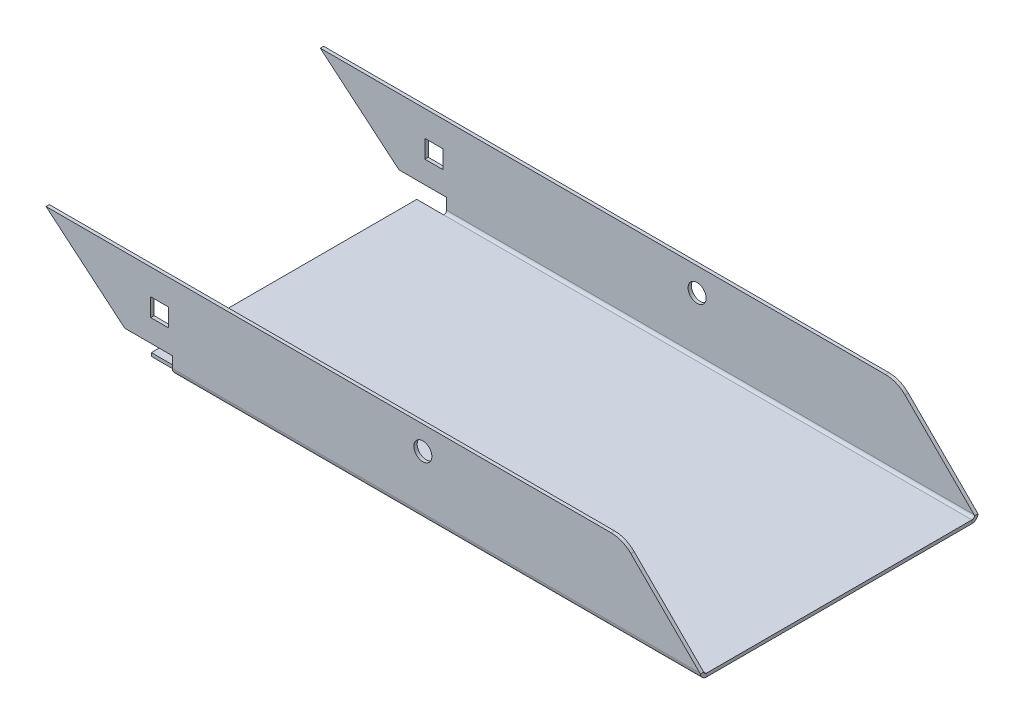
ISO-10303-21;
HEADER;
FILE_DESCRIPTION(('STEP AP214'),'2;1');
FILE_NAME('part.step','',(''),(''),'','','');
FILE_SCHEMA(('AUTOMOTIVE_DESIGN { 1 0 10303 214 1 1 1 1 }'));
ENDSEC;
DATA;
#1=APPLICATION_CONTEXT('core data for automotive mechanical design processes');
#2=APPLICATION_PROTOCOL_DEFINITION('international standard','automotive_design',2000,#1);
#3=PRODUCT_CONTEXT('',#1,'mechanical');
#4=PRODUCT('Part','Part','',(#3));
#5=PRODUCT_RELATED_PRODUCT_CATEGORY('part','',(#4));
#6=PRODUCT_DEFINITION_FORMATION('','',#4);
#7=PRODUCT_DEFINITION_CONTEXT('part definition',#1,'design');
#8=PRODUCT_DEFINITION('design','',#6,#7);
#9=PRODUCT_DEFINITION_SHAPE('','',#8);
#10=(LENGTH_UNIT() NAMED_UNIT(*) SI_UNIT(.MILLI.,.METRE.));
#11=(NAMED_UNIT(*) PLANE_ANGLE_UNIT() SI_UNIT($,.RADIAN.));
#12=(NAMED_UNIT(*) SI_UNIT($,.STERADIAN.) SOLID_ANGLE_UNIT());
#13=UNCERTAINTY_MEASURE_WITH_UNIT(LENGTH_MEASURE(1.E-05),#10,'distance_accuracy_value','');
#14=(GEOMETRIC_REPRESENTATION_CONTEXT(3) GLOBAL_UNCERTAINTY_ASSIGNED_CONTEXT((#13)) GLOBAL_UNIT_ASSIGNED_CONTEXT((#10,
#11,#12)) REPRESENTATION_CONTEXT('',''));
#15=CARTESIAN_POINT('',(0.,0.,0.));
#16=DIRECTION('',(0.,0.,1.));
#17=DIRECTION('',(1.,0.,0.));
#18=AXIS2_PLACEMENT_3D('',#15,#16,#17);
#19=CARTESIAN_POINT('',(200.,-15.,48.8));
#20=DIRECTION('',(0.,0.,1.));
#21=DIRECTION('',(1.,0.,0.));
#22=AXIS2_PLACEMENT_3D('',#19,#20,#21);
#23=PLANE('',#22);
#24=CARTESIAN_POINT('',(100.000000000001,6.49999999999818,48.8));
#25=DIRECTION('',(0.,0.,1.));
#26=DIRECTION('',(1.,0.,0.));
#27=AXIS2_PLACEMENT_3D('',#24,#25,#26);
#28=CIRCLE('',#27,3.25000000000001);
#29=CARTESIAN_POINT('',(103.250000000001,6.49999999999818,48.8));
#30=VERTEX_POINT('',#29);
#31=EDGE_CURVE('E262',#30,#30,#28,.T.);
#32=ORIENTED_EDGE('',*,*,#31,.T.);
#33=EDGE_LOOP('',(#32));
#34=FACE_BOUND('',#33,.T.);
#35=DIRECTION('',(1.,0.,0.));
#36=VECTOR('',#35,1.);
#37=CARTESIAN_POINT('',(200.,-0.800000000000054,48.8));
#38=LINE('',#37,#36);
#39=CARTESIAN_POINT('',(1.9666765136914,-0.800000000000054,48.8));
#40=VERTEX_POINT('',#39);
#41=CARTESIAN_POINT('',(8.4666765136914,-0.800000000000054,48.8));
#42=VERTEX_POINT('',#41);
#43=EDGE_CURVE('E290',#40,#42,#38,.T.);
#44=ORIENTED_EDGE('',*,*,#43,.T.);
#45=DIRECTION('',(0.,1.,0.));
#46=VECTOR('',#45,1.);
#47=CARTESIAN_POINT('',(8.4666765136914,-15.,48.8));
#48=LINE('',#47,#46);
#49=CARTESIAN_POINT('',(8.4666765136914,5.69999999999995,48.8));
#50=VERTEX_POINT('',#49);
#51=EDGE_CURVE('E296',#42,#50,#48,.T.);
#52=ORIENTED_EDGE('',*,*,#51,.T.);
#53=DIRECTION('',(-1.,0.,0.));
#54=VECTOR('',#53,1.);
#55=CARTESIAN_POINT('',(200.,5.69999999999995,48.8));
#56=LINE('',#55,#54);
#57=CARTESIAN_POINT('',(1.9666765136914,5.69999999999995,48.8));
#58=VERTEX_POINT('',#57);
#59=EDGE_CURVE('E280',#50,#58,#56,.T.);
#60=ORIENTED_EDGE('',*,*,#59,.T.);
#61=DIRECTION('',(0.,-1.,0.));
#62=VECTOR('',#61,1.);
#63=CARTESIAN_POINT('',(1.9666765136914,-15.,48.8));
#64=LINE('',#63,#62);
#65=EDGE_CURVE('E285',#58,#40,#64,.T.);
#66=ORIENTED_EDGE('',*,*,#65,.T.);
#67=EDGE_LOOP('',(#44,#52,#60,#66));
#68=FACE_BOUND('',#67,.T.);
#69=DIRECTION('',(-1.,0.,0.));
#70=VECTOR('',#69,1.);
#71=CARTESIAN_POINT('',(200.,15.,48.8));
#72=LINE('',#71,#70);
#73=CARTESIAN_POINT('',(167.857864376269,15.,48.8));
#74=VERTEX_POINT('',#73);
#75=CARTESIAN_POINT('',(-35.7526077778259,15.,48.8));
#76=VERTEX_POINT('',#75);
#77=EDGE_CURVE('E429',#74,#76,#72,.T.);
#78=ORIENTED_EDGE('',*,*,#77,.F.);
#79=CARTESIAN_POINT('',(167.857864376269,5.,48.8));
#80=DIRECTION('',(0.,0.,1.));
#81=DIRECTION('',(1.,0.,0.));
#82=AXIS2_PLACEMENT_3D('',#79,#80,#81);
#83=CIRCLE('',#82,10.);
#84=CARTESIAN_POINT('',(174.928932188134,12.0710678118655,48.8));
#85=VERTEX_POINT('',#84);
#86=EDGE_CURVE('E60',#74,#85,#83,.F.);
#87=ORIENTED_EDGE('',*,*,#86,.T.);
#88=DIRECTION('',(-0.707106781186551,0.707106781186544,0.));
#89=VECTOR('',#88,1.);
#90=CARTESIAN_POINT('',(172.,15.,48.8));
#91=LINE('',#90,#89);
#92=CARTESIAN_POINT('',(199.8,-12.8,48.8));
#93=VERTEX_POINT('',#92);
#94=EDGE_CURVE('E462',#85,#93,#91,.F.);
#95=ORIENTED_EDGE('',*,*,#94,.T.);
#96=DIRECTION('',(-1.,0.,0.));
#97=VECTOR('',#96,1.);
#98=CARTESIAN_POINT('',(200.,-12.8,48.8));
#99=LINE('',#98,#97);
#100=CARTESIAN_POINT('',(9.73298562962322,-12.8,48.8));
#101=VERTEX_POINT('',#100);
#102=EDGE_CURVE('E399',#93,#101,#99,.T.);
#103=ORIENTED_EDGE('',*,*,#102,.T.);
#104=DIRECTION('',(0.,1.,0.));
#105=VECTOR('',#104,1.);
#106=CARTESIAN_POINT('',(9.73298562962322,-15.,48.8));
#107=LINE('',#106,#105);
#108=CARTESIAN_POINT('',(9.73298562962322,-8.80000000000001,48.8));
#109=VERTEX_POINT('',#108);
#110=EDGE_CURVE('E343',#101,#109,#107,.T.);
#111=ORIENTED_EDGE('',*,*,#110,.T.);
#112=DIRECTION('',(-1.,0.,0.));
#113=VECTOR('',#112,1.);
#114=CARTESIAN_POINT('',(200.,-8.80000000000003,48.8));
#115=LINE('',#114,#113);
#116=CARTESIAN_POINT('',(-7.38887227408402,-8.8,48.8));
#117=VERTEX_POINT('',#116);
#118=EDGE_CURVE('E335',#109,#117,#115,.T.);
#119=ORIENTED_EDGE('',*,*,#118,.T.);
#120=DIRECTION('',(0.766044443118975,-0.642787609686543,0.));
#121=VECTOR('',#120,1.);
#122=CARTESIAN_POINT('',(-35.7526077778259,15.,48.8));
#123=LINE('',#122,#121);
#124=EDGE_CURVE('E373',#76,#117,#123,.T.);
#125=ORIENTED_EDGE('',*,*,#124,.F.);
#126=EDGE_LOOP('',(#78,#87,#95,#103,#111,#119,#125));
#127=FACE_BOUND('',#126,.T.);
#128=ADVANCED_FACE('F37',(#34,#68,#127),#23,.F.);
#129=CARTESIAN_POINT('',(200.,-15.,50.));
#130=DIRECTION('',(0.,0.,1.));
#131=DIRECTION('',(1.,0.,0.));
#132=AXIS2_PLACEMENT_3D('',#129,#130,#131);
#133=PLANE('',#132);
#134=CARTESIAN_POINT('',(100.000000000001,6.49999999999818,50.));
#135=DIRECTION('',(0.,0.,1.));
#136=DIRECTION('',(1.,0.,0.));
#137=AXIS2_PLACEMENT_3D('',#134,#135,#136);
#138=CIRCLE('',#137,3.25000000000001);
#139=CARTESIAN_POINT('',(103.250000000001,6.49999999999818,50.));
#140=VERTEX_POINT('',#139);
#141=EDGE_CURVE('E971',#140,#140,#138,.T.);
#142=ORIENTED_EDGE('',*,*,#141,.F.);
#143=EDGE_LOOP('',(#142));
#144=FACE_BOUND('',#143,.T.);
#145=DIRECTION('',(0.,1.,0.));
#146=VECTOR('',#145,1.);
#147=CARTESIAN_POINT('',(8.4666765136914,-15.,50.));
#148=LINE('',#147,#146);
#149=CARTESIAN_POINT('',(8.4666765136914,-0.800000000000054,50.));
#150=VERTEX_POINT('',#149);
#151=CARTESIAN_POINT('',(8.4666765136914,5.69999999999995,50.));
#152=VERTEX_POINT('',#151);
#153=EDGE_CURVE('E293',#150,#152,#148,.T.);
#154=ORIENTED_EDGE('',*,*,#153,.F.);
#155=DIRECTION('',(1.,0.,0.));
#156=VECTOR('',#155,1.);
#157=CARTESIAN_POINT('',(200.,-0.800000000000054,50.));
#158=LINE('',#157,#156);
#159=CARTESIAN_POINT('',(1.9666765136914,-0.800000000000054,50.));
#160=VERTEX_POINT('',#159);
#161=EDGE_CURVE('E288',#160,#150,#158,.T.);
#162=ORIENTED_EDGE('',*,*,#161,.F.);
#163=DIRECTION('',(0.,-1.,0.));
#164=VECTOR('',#163,1.);
#165=CARTESIAN_POINT('',(1.9666765136914,-15.,50.));
#166=LINE('',#165,#164);
#167=CARTESIAN_POINT('',(1.9666765136914,5.69999999999995,50.));
#168=VERTEX_POINT('',#167);
#169=EDGE_CURVE('E283',#168,#160,#166,.T.);
#170=ORIENTED_EDGE('',*,*,#169,.F.);
#171=DIRECTION('',(-1.,0.,0.));
#172=VECTOR('',#171,1.);
#173=CARTESIAN_POINT('',(200.,5.69999999999995,50.));
#174=LINE('',#173,#172);
#175=EDGE_CURVE('E272',#152,#168,#174,.T.);
#176=ORIENTED_EDGE('',*,*,#175,.F.);
#177=EDGE_LOOP('',(#154,#162,#170,#176));
#178=FACE_BOUND('',#177,.T.);
#179=DIRECTION('',(0.707106781186551,-0.707106781186544,0.));
#180=VECTOR('',#179,1.);
#181=CARTESIAN_POINT('',(201.,-14.0000000000001,50.));
#182=LINE('',#181,#180);
#183=CARTESIAN_POINT('',(199.8,-12.8,50.));
#184=VERTEX_POINT('',#183);
#185=CARTESIAN_POINT('',(174.928932188134,12.0710678118655,50.));
#186=VERTEX_POINT('',#185);
#187=EDGE_CURVE('E470',#184,#186,#182,.F.);
#188=ORIENTED_EDGE('',*,*,#187,.T.);
#189=CARTESIAN_POINT('',(167.857864376269,5.,50.));
#190=DIRECTION('',(0.,0.,1.));
#191=DIRECTION('',(1.,0.,0.));
#192=AXIS2_PLACEMENT_3D('',#189,#190,#191);
#193=CIRCLE('',#192,10.);
#194=CARTESIAN_POINT('',(167.857864376269,15.,50.));
#195=VERTEX_POINT('',#194);
#196=EDGE_CURVE('E11',#186,#195,#193,.T.);
#197=ORIENTED_EDGE('',*,*,#196,.T.);
#198=DIRECTION('',(-1.,0.,0.));
#199=VECTOR('',#198,1.);
#200=CARTESIAN_POINT('',(200.,15.,50.));
#201=LINE('',#200,#199);
#202=CARTESIAN_POINT('',(-35.7526077778259,15.,50.));
#203=VERTEX_POINT('',#202);
#204=EDGE_CURVE('E427',#195,#203,#201,.T.);
#205=ORIENTED_EDGE('',*,*,#204,.T.);
#206=DIRECTION('',(0.766044443118975,-0.642787609686543,0.));
#207=VECTOR('',#206,1.);
#208=CARTESIAN_POINT('',(-35.7526077778259,15.,50.));
#209=LINE('',#208,#207);
#210=CARTESIAN_POINT('',(-7.38887227408402,-8.8,50.));
#211=VERTEX_POINT('',#210);
#212=EDGE_CURVE('E372',#203,#211,#209,.T.);
#213=ORIENTED_EDGE('',*,*,#212,.T.);
#214=DIRECTION('',(1.,0.,0.));
#215=VECTOR('',#214,1.);
#216=CARTESIAN_POINT('',(200.,-8.80000000000001,50.));
#217=LINE('',#216,#215);
#218=CARTESIAN_POINT('',(9.73298562962322,-8.80000000000001,50.));
#219=VERTEX_POINT('',#218);
#220=EDGE_CURVE('E341',#219,#211,#217,.F.);
#221=ORIENTED_EDGE('',*,*,#220,.F.);
#222=DIRECTION('',(0.,1.,0.));
#223=VECTOR('',#222,1.);
#224=CARTESIAN_POINT('',(9.73298562962322,-15.,50.));
#225=LINE('',#224,#223);
#226=CARTESIAN_POINT('',(9.73298562962322,-12.8,50.));
#227=VERTEX_POINT('',#226);
#228=EDGE_CURVE('E310',#227,#219,#225,.T.);
#229=ORIENTED_EDGE('',*,*,#228,.F.);
#230=DIRECTION('',(-1.,0.,0.));
#231=VECTOR('',#230,1.);
#232=CARTESIAN_POINT('',(200.,-12.8,50.));
#233=LINE('',#232,#231);
#234=EDGE_CURVE('E425',#184,#227,#233,.T.);
#235=ORIENTED_EDGE('',*,*,#234,.F.);
#236=EDGE_LOOP('',(#188,#197,#205,#213,#221,#229,#235));
#237=FACE_BOUND('',#236,.T.);
#238=ADVANCED_FACE('F498',(#144,#178,#237),#133,.T.);
#239=CARTESIAN_POINT('',(200.,-12.8,47.8));
#240=DIRECTION('',(-1.,0.,0.));
#241=DIRECTION('',(0.,0.,1.));
#242=AXIS2_PLACEMENT_3D('',#239,#240,#241);
#243=CYLINDRICAL_SURFACE('',#242,2.2);
#244=CARTESIAN_POINT('',(200.,-12.8,47.8));
#245=DIRECTION('',(1.,0.,0.));
#246=DIRECTION('',(0.,0.,-1.));
#247=AXIS2_PLACEMENT_3D('',#244,#245,#246);
#248=CIRCLE('',#247,2.2);
#249=CARTESIAN_POINT('',(200.,-15.,47.8));
#250=VERTEX_POINT('',#249);
#251=CARTESIAN_POINT('',(200.,-13.0000000000002,49.9908902300207));
#252=VERTEX_POINT('',#251);
#253=EDGE_CURVE('E382',#250,#252,#248,.F.);
#254=ORIENTED_EDGE('',*,*,#253,.T.);
#255=CARTESIAN_POINT('',(199.8,-12.8,47.8));
#256=DIRECTION('',(-0.707106781186544,-0.707106781186551,0.));
#257=DIRECTION('',(-0.707106781186551,0.707106781186544,0.));
#258=AXIS2_PLACEMENT_3D('',#255,#256,#257);
#259=ELLIPSE('',#258,3.11126983722083,2.2);
#260=EDGE_CURVE('E468',#252,#184,#259,.T.);
#261=ORIENTED_EDGE('',*,*,#260,.T.);
#262=ORIENTED_EDGE('',*,*,#234,.T.);
#263=CARTESIAN_POINT('',(9.73298562962322,-12.8,47.8));
#264=DIRECTION('',(1.,0.,0.));
#265=DIRECTION('',(0.,0.,-1.));
#266=AXIS2_PLACEMENT_3D('',#263,#264,#265);
#267=CIRCLE('',#266,2.2);
#268=CARTESIAN_POINT('',(9.73298562962322,-15.,47.8));
#269=VERTEX_POINT('',#268);
#270=EDGE_CURVE('E329',#227,#269,#267,.T.);
#271=ORIENTED_EDGE('',*,*,#270,.T.);
#272=DIRECTION('',(-1.,0.,0.));
#273=VECTOR('',#272,1.);
#274=CARTESIAN_POINT('',(200.,-15.,47.8));
#275=LINE('',#274,#273);
#276=EDGE_CURVE('E422',#250,#269,#275,.T.);
#277=ORIENTED_EDGE('',*,*,#276,.F.);
#278=EDGE_LOOP('',(#254,#261,#262,#271,#277));
#279=FACE_BOUND('',#278,.T.);
#280=ADVANCED_FACE('F519',(#279),#243,.T.);
#281=CARTESIAN_POINT('',(200.,-12.8,-47.8));
#282=DIRECTION('',(-1.,0.,0.));
#283=DIRECTION('',(0.,0.,1.));
#284=AXIS2_PLACEMENT_3D('',#281,#282,#283);
#285=CYLINDRICAL_SURFACE('',#284,2.2);
#286=DIRECTION('',(-1.,0.,0.));
#287=VECTOR('',#286,1.);
#288=CARTESIAN_POINT('',(200.,-12.8,-50.));
#289=LINE('',#288,#287);
#290=CARTESIAN_POINT('',(199.8,-12.8,-50.));
#291=VERTEX_POINT('',#290);
#292=CARTESIAN_POINT('',(9.73298562962322,-12.8,-50.));
#293=VERTEX_POINT('',#292);
#294=EDGE_CURVE('E417',#291,#293,#289,.T.);
#295=ORIENTED_EDGE('',*,*,#294,.F.);
#296=CARTESIAN_POINT('',(199.8,-12.8,-47.8));
#297=DIRECTION('',(-0.707106781186544,-0.707106781186551,0.));
#298=DIRECTION('',(-0.707106781186551,0.707106781186544,0.));
#299=AXIS2_PLACEMENT_3D('',#296,#297,#298);
#300=ELLIPSE('',#299,3.11126983722083,2.2);
#301=CARTESIAN_POINT('',(200.,-13.0000000000002,-49.9908902300206));
#302=VERTEX_POINT('',#301);
#303=EDGE_CURVE('E453',#291,#302,#300,.T.);
#304=ORIENTED_EDGE('',*,*,#303,.T.);
#305=CARTESIAN_POINT('',(200.,-12.8,-47.8));
#306=DIRECTION('',(1.,0.,0.));
#307=DIRECTION('',(0.,0.,-1.));
#308=AXIS2_PLACEMENT_3D('',#305,#306,#307);
#309=CIRCLE('',#308,2.2);
#310=CARTESIAN_POINT('',(200.,-15.,-47.8));
#311=VERTEX_POINT('',#310);
#312=EDGE_CURVE('E389',#302,#311,#309,.F.);
#313=ORIENTED_EDGE('',*,*,#312,.T.);
#314=DIRECTION('',(-1.,0.,0.));
#315=VECTOR('',#314,1.);
#316=CARTESIAN_POINT('',(200.,-15.,-47.8));
#317=LINE('',#316,#315);
#318=CARTESIAN_POINT('',(9.73298562962322,-15.,-47.8));
#319=VERTEX_POINT('',#318);
#320=EDGE_CURVE('E419',#311,#319,#317,.T.);
#321=ORIENTED_EDGE('',*,*,#320,.T.);
#322=CARTESIAN_POINT('',(9.73298562962322,-12.8,-47.8));
#323=DIRECTION('',(1.,0.,0.));
#324=DIRECTION('',(0.,0.,-1.));
#325=AXIS2_PLACEMENT_3D('',#322,#323,#324);
#326=CIRCLE('',#325,2.2);
#327=EDGE_CURVE('E360',#319,#293,#326,.T.);
#328=ORIENTED_EDGE('',*,*,#327,.T.);
#329=EDGE_LOOP('',(#295,#304,#313,#321,#328));
#330=FACE_BOUND('',#329,.T.);
#331=ADVANCED_FACE('F629',(#330),#285,.T.);
#332=CARTESIAN_POINT('',(200.,-15.,-50.));
#333=DIRECTION('',(0.,0.,-1.));
#334=DIRECTION('',(-1.,0.,0.));
#335=AXIS2_PLACEMENT_3D('',#332,#333,#334);
#336=PLANE('',#335);
#337=CARTESIAN_POINT('',(100.000000000001,6.49999999999818,-50.));
#338=DIRECTION('',(0.,0.,1.));
#339=DIRECTION('',(1.,0.,0.));
#340=AXIS2_PLACEMENT_3D('',#337,#338,#339);
#341=CIRCLE('',#340,3.25000000000001);
#342=CARTESIAN_POINT('',(103.250000000001,6.49999999999818,-50.));
#343=VERTEX_POINT('',#342);
#344=EDGE_CURVE('E973',#343,#343,#341,.T.);
#345=ORIENTED_EDGE('',*,*,#344,.T.);
#346=EDGE_LOOP('',(#345));
#347=FACE_BOUND('',#346,.T.);
#348=DIRECTION('',(0.,1.,0.));
#349=VECTOR('',#348,1.);
#350=CARTESIAN_POINT('',(8.4666765136914,-0.800000000000054,-50.));
#351=LINE('',#350,#349);
#352=CARTESIAN_POINT('',(8.4666765136914,-0.800000000000054,-50.));
#353=VERTEX_POINT('',#352);
#354=CARTESIAN_POINT('',(8.4666765136914,5.69999999999995,-50.));
#355=VERTEX_POINT('',#354);
#356=EDGE_CURVE('E239',#353,#355,#351,.T.);
#357=ORIENTED_EDGE('',*,*,#356,.T.);
#358=DIRECTION('',(-1.,0.,0.));
#359=VECTOR('',#358,1.);
#360=CARTESIAN_POINT('',(1.9666765136914,5.69999999999995,-50.));
#361=LINE('',#360,#359);
#362=CARTESIAN_POINT('',(1.9666765136914,5.69999999999995,-50.));
#363=VERTEX_POINT('',#362);
#364=EDGE_CURVE('E250',#355,#363,#361,.T.);
#365=ORIENTED_EDGE('',*,*,#364,.T.);
#366=DIRECTION('',(0.,-1.,0.));
#367=VECTOR('',#366,1.);
#368=CARTESIAN_POINT('',(1.9666765136914,-0.800000000000054,-50.));
#369=LINE('',#368,#367);
#370=CARTESIAN_POINT('',(1.9666765136914,-0.800000000000054,-50.));
#371=VERTEX_POINT('',#370);
#372=EDGE_CURVE('E256',#363,#371,#369,.T.);
#373=ORIENTED_EDGE('',*,*,#372,.T.);
#374=DIRECTION('',(1.,0.,0.));
#375=VECTOR('',#374,1.);
#376=CARTESIAN_POINT('',(1.9666765136914,-0.800000000000054,-50.));
#377=LINE('',#376,#375);
#378=EDGE_CURVE('E261',#371,#353,#377,.T.);
#379=ORIENTED_EDGE('',*,*,#378,.T.);
#380=EDGE_LOOP('',(#357,#365,#373,#379));
#381=FACE_BOUND('',#380,.T.);
#382=DIRECTION('',(-1.,0.,0.));
#383=VECTOR('',#382,1.);
#384=CARTESIAN_POINT('',(200.,15.,-50.));
#385=LINE('',#384,#383);
#386=CARTESIAN_POINT('',(167.857864376269,15.,-50.));
#387=VERTEX_POINT('',#386);
#388=CARTESIAN_POINT('',(-35.7526077778259,15.,-50.));
#389=VERTEX_POINT('',#388);
#390=EDGE_CURVE('E415',#387,#389,#385,.T.);
#391=ORIENTED_EDGE('',*,*,#390,.F.);
#392=CARTESIAN_POINT('',(167.857864376269,5.,-50.));
#393=DIRECTION('',(0.,0.,-1.));
#394=DIRECTION('',(-1.,0.,0.));
#395=AXIS2_PLACEMENT_3D('',#392,#393,#394);
#396=CIRCLE('',#395,10.);
#397=CARTESIAN_POINT('',(174.928932188134,12.0710678118655,-50.));
#398=VERTEX_POINT('',#397);
#399=EDGE_CURVE('E475',#387,#398,#396,.T.);
#400=ORIENTED_EDGE('',*,*,#399,.T.);
#401=DIRECTION('',(-0.707106781186551,0.707106781186544,0.));
#402=VECTOR('',#401,1.);
#403=CARTESIAN_POINT('',(201.,-14.0000000000001,-50.));
#404=LINE('',#403,#402);
#405=EDGE_CURVE('E451',#398,#291,#404,.F.);
#406=ORIENTED_EDGE('',*,*,#405,.T.);
#407=ORIENTED_EDGE('',*,*,#294,.T.);
#408=DIRECTION('',(0.,1.,0.));
#409=VECTOR('',#408,1.);
#410=CARTESIAN_POINT('',(9.73298562962322,-15.,-50.));
#411=LINE('',#410,#409);
#412=CARTESIAN_POINT('',(9.73298562962322,-8.8,-50.));
#413=VERTEX_POINT('',#412);
#414=EDGE_CURVE('E303',#293,#413,#411,.T.);
#415=ORIENTED_EDGE('',*,*,#414,.T.);
#416=DIRECTION('',(-1.,0.,0.));
#417=VECTOR('',#416,1.);
#418=CARTESIAN_POINT('',(200.,-8.80000000000002,-50.));
#419=LINE('',#418,#417);
#420=CARTESIAN_POINT('',(-7.38887227408391,-8.8,-50.));
#421=VERTEX_POINT('',#420);
#422=EDGE_CURVE('E300',#413,#421,#419,.T.);
#423=ORIENTED_EDGE('',*,*,#422,.T.);
#424=DIRECTION('',(0.766044443118975,-0.642787609686543,0.));
#425=VECTOR('',#424,1.);
#426=CARTESIAN_POINT('',(-35.7526077778259,15.,-50.));
#427=LINE('',#426,#425);
#428=EDGE_CURVE('E363',#389,#421,#427,.T.);
#429=ORIENTED_EDGE('',*,*,#428,.F.);
#430=EDGE_LOOP('',(#391,#400,#406,#407,#415,#423,#429));
#431=FACE_BOUND('',#430,.T.);
#432=ADVANCED_FACE('F258',(#347,#381,#431),#336,.T.);
#433=CARTESIAN_POINT('',(200.,-15.,-48.8));
#434=DIRECTION('',(0.,0.,-1.));
#435=DIRECTION('',(-1.,0.,0.));
#436=AXIS2_PLACEMENT_3D('',#433,#434,#435);
#437=PLANE('',#436);
#438=CARTESIAN_POINT('',(100.000000000001,6.49999999999818,-48.8));
#439=DIRECTION('',(0.,0.,-1.));
#440=DIRECTION('',(-1.,0.,0.));
#441=AXIS2_PLACEMENT_3D('',#438,#439,#440);
#442=CIRCLE('',#441,3.25000000000001);
#443=CARTESIAN_POINT('',(96.750000000001,6.49999999999818,-48.8));
#444=VERTEX_POINT('',#443);
#445=EDGE_CURVE('E41',#444,#444,#442,.T.);
#446=ORIENTED_EDGE('',*,*,#445,.T.);
#447=EDGE_LOOP('',(#446));
#448=FACE_BOUND('',#447,.T.);
#449=DIRECTION('',(1.,0.,0.));
#450=VECTOR('',#449,1.);
#451=CARTESIAN_POINT('',(200.,5.69999999999995,-48.8));
#452=LINE('',#451,#450);
#453=CARTESIAN_POINT('',(1.9666765136914,5.69999999999995,-48.8));
#454=VERTEX_POINT('',#453);
#455=CARTESIAN_POINT('',(8.4666765136914,5.69999999999995,-48.8));
#456=VERTEX_POINT('',#455);
#457=EDGE_CURVE('E442',#454,#456,#452,.T.);
#458=ORIENTED_EDGE('',*,*,#457,.T.);
#459=DIRECTION('',(0.,-1.,0.));
#460=VECTOR('',#459,1.);
#461=CARTESIAN_POINT('',(8.4666765136914,-15.,-48.8));
#462=LINE('',#461,#460);
#463=CARTESIAN_POINT('',(8.4666765136914,-0.800000000000054,-48.8));
#464=VERTEX_POINT('',#463);
#465=EDGE_CURVE('E242',#456,#464,#462,.T.);
#466=ORIENTED_EDGE('',*,*,#465,.T.);
#467=DIRECTION('',(-1.,0.,0.));
#468=VECTOR('',#467,1.);
#469=CARTESIAN_POINT('',(200.,-0.800000000000054,-48.8));
#470=LINE('',#469,#468);
#471=CARTESIAN_POINT('',(1.9666765136914,-0.800000000000054,-48.8));
#472=VERTEX_POINT('',#471);
#473=EDGE_CURVE('E447',#464,#472,#470,.T.);
#474=ORIENTED_EDGE('',*,*,#473,.T.);
#475=DIRECTION('',(0.,1.,0.));
#476=VECTOR('',#475,1.);
#477=CARTESIAN_POINT('',(1.9666765136914,-15.,-48.8));
#478=LINE('',#477,#476);
#479=EDGE_CURVE('E444',#472,#454,#478,.T.);
#480=ORIENTED_EDGE('',*,*,#479,.T.);
#481=EDGE_LOOP('',(#458,#466,#474,#480));
#482=FACE_BOUND('',#481,.T.);
#483=DIRECTION('',(0.707106781186551,-0.707106781186544,0.));
#484=VECTOR('',#483,1.);
#485=CARTESIAN_POINT('',(172.,15.,-48.8));
#486=LINE('',#485,#484);
#487=CARTESIAN_POINT('',(199.8,-12.8,-48.8));
#488=VERTEX_POINT('',#487);
#489=CARTESIAN_POINT('',(174.928932188134,12.0710678118655,-48.8));
#490=VERTEX_POINT('',#489);
#491=EDGE_CURVE('E459',#488,#490,#486,.F.);
#492=ORIENTED_EDGE('',*,*,#491,.T.);
#493=CARTESIAN_POINT('',(167.857864376269,5.,-48.8));
#494=DIRECTION('',(0.,0.,-1.));
#495=DIRECTION('',(-1.,0.,0.));
#496=AXIS2_PLACEMENT_3D('',#493,#494,#495);
#497=CIRCLE('',#496,10.);
#498=CARTESIAN_POINT('',(167.857864376269,15.,-48.8));
#499=VERTEX_POINT('',#498);
#500=EDGE_CURVE('E479',#490,#499,#497,.F.);
#501=ORIENTED_EDGE('',*,*,#500,.T.);
#502=DIRECTION('',(-1.,0.,0.));
#503=VECTOR('',#502,1.);
#504=CARTESIAN_POINT('',(200.,15.,-48.8));
#505=LINE('',#504,#503);
#506=CARTESIAN_POINT('',(-35.7526077778259,15.,-48.8));
#507=VERTEX_POINT('',#506);
#508=EDGE_CURVE('E413',#499,#507,#505,.T.);
#509=ORIENTED_EDGE('',*,*,#508,.T.);
#510=DIRECTION('',(0.766044443118975,-0.642787609686543,0.));
#511=VECTOR('',#510,1.);
#512=CARTESIAN_POINT('',(-35.7526077778259,15.,-48.8));
#513=LINE('',#512,#511);
#514=CARTESIAN_POINT('',(-7.38887227408392,-8.80000000000008,-48.8));
#515=VERTEX_POINT('',#514);
#516=EDGE_CURVE('E364',#507,#515,#513,.T.);
#517=ORIENTED_EDGE('',*,*,#516,.T.);
#518=DIRECTION('',(1.,0.,0.));
#519=VECTOR('',#518,1.);
#520=CARTESIAN_POINT('',(1.17205667776964,-8.8,-48.8));
#521=LINE('',#520,#519);
#522=CARTESIAN_POINT('',(9.73298562962322,-8.8,-48.8));
#523=VERTEX_POINT('',#522);
#524=EDGE_CURVE('E308',#523,#515,#521,.F.);
#525=ORIENTED_EDGE('',*,*,#524,.F.);
#526=DIRECTION('',(0.,1.,0.));
#527=VECTOR('',#526,1.);
#528=CARTESIAN_POINT('',(9.73298562962322,-10.8,-48.8));
#529=LINE('',#528,#527);
#530=CARTESIAN_POINT('',(9.73298562962322,-12.8,-48.8));
#531=VERTEX_POINT('',#530);
#532=EDGE_CURVE('E304',#531,#523,#529,.T.);
#533=ORIENTED_EDGE('',*,*,#532,.F.);
#534=DIRECTION('',(-1.,0.,0.));
#535=VECTOR('',#534,1.);
#536=CARTESIAN_POINT('',(200.,-12.8,-48.8));
#537=LINE('',#536,#535);
#538=EDGE_CURVE('E411',#488,#531,#537,.T.);
#539=ORIENTED_EDGE('',*,*,#538,.F.);
#540=EDGE_LOOP('',(#492,#501,#509,#517,#525,#533,#539));
#541=FACE_BOUND('',#540,.T.);
#542=ADVANCED_FACE('F619',(#448,#482,#541),#437,.F.);
#543=CARTESIAN_POINT('',(200.,-12.8,-47.8));
#544=DIRECTION('',(-1.,0.,0.));
#545=DIRECTION('',(0.,0.,1.));
#546=AXIS2_PLACEMENT_3D('',#543,#544,#545);
#547=CYLINDRICAL_SURFACE('',#546,1.);
#548=CARTESIAN_POINT('',(200.,-12.8,-47.8));
#549=DIRECTION('',(1.,0.,0.));
#550=DIRECTION('',(0.,0.,-1.));
#551=AXIS2_PLACEMENT_3D('',#548,#549,#550);
#552=CIRCLE('',#551,1.);
#553=CARTESIAN_POINT('',(200.,-13.0000000000002,-48.7797958971132));
#554=VERTEX_POINT('',#553);
#555=CARTESIAN_POINT('',(200.,-13.8,-47.8));
#556=VERTEX_POINT('',#555);
#557=EDGE_CURVE('E391',#554,#556,#552,.F.);
#558=ORIENTED_EDGE('',*,*,#557,.F.);
#559=CARTESIAN_POINT('',(199.8,-12.8,-47.8));
#560=DIRECTION('',(-0.707106781186544,-0.707106781186551,0.));
#561=DIRECTION('',(-0.707106781186551,0.707106781186544,0.));
#562=AXIS2_PLACEMENT_3D('',#559,#560,#561);
#563=ELLIPSE('',#562,1.4142135623731,1.);
#564=EDGE_CURVE('E457',#554,#488,#563,.F.);
#565=ORIENTED_EDGE('',*,*,#564,.T.);
#566=ORIENTED_EDGE('',*,*,#538,.T.);
#567=CARTESIAN_POINT('',(9.73298562962322,-12.8,-47.8));
#568=DIRECTION('',(1.,0.,0.));
#569=DIRECTION('',(0.,0.,-1.));
#570=AXIS2_PLACEMENT_3D('',#567,#568,#569);
#571=CIRCLE('',#570,1.);
#572=CARTESIAN_POINT('',(9.73298562962322,-13.8,-47.8));
#573=VERTEX_POINT('',#572);
#574=EDGE_CURVE('E354',#573,#531,#571,.T.);
#575=ORIENTED_EDGE('',*,*,#574,.F.);
#576=DIRECTION('',(-1.,0.,0.));
#577=VECTOR('',#576,1.);
#578=CARTESIAN_POINT('',(200.,-13.8,-47.8));
#579=LINE('',#578,#577);
#580=EDGE_CURVE('E408',#556,#573,#579,.T.);
#581=ORIENTED_EDGE('',*,*,#580,.F.);
#582=EDGE_LOOP('',(#558,#565,#566,#575,#581));
#583=FACE_BOUND('',#582,.T.);
#584=ADVANCED_FACE('F613',(#583),#547,.F.);
#585=CARTESIAN_POINT('',(200.,-12.8,47.8));
#586=DIRECTION('',(-1.,0.,0.));
#587=DIRECTION('',(0.,0.,1.));
#588=AXIS2_PLACEMENT_3D('',#585,#586,#587);
#589=CYLINDRICAL_SURFACE('',#588,1.);
#590=ORIENTED_EDGE('',*,*,#102,.F.);
#591=CARTESIAN_POINT('',(199.8,-12.8,47.8));
#592=DIRECTION('',(-0.707106781186544,-0.707106781186551,0.));
#593=DIRECTION('',(-0.707106781186551,0.707106781186544,0.));
#594=AXIS2_PLACEMENT_3D('',#591,#592,#593);
#595=ELLIPSE('',#594,1.4142135623731,1.);
#596=CARTESIAN_POINT('',(200.,-13.0000000000002,48.7797958971132));
#597=VERTEX_POINT('',#596);
#598=EDGE_CURVE('E464',#93,#597,#595,.F.);
#599=ORIENTED_EDGE('',*,*,#598,.T.);
#600=CARTESIAN_POINT('',(200.,-12.8,47.8));
#601=DIRECTION('',(1.,0.,0.));
#602=DIRECTION('',(0.,0.,-1.));
#603=AXIS2_PLACEMENT_3D('',#600,#601,#602);
#604=CIRCLE('',#603,1.);
#605=CARTESIAN_POINT('',(200.,-13.8,47.8));
#606=VERTEX_POINT('',#605);
#607=EDGE_CURVE('E396',#606,#597,#604,.F.);
#608=ORIENTED_EDGE('',*,*,#607,.F.);
#609=DIRECTION('',(-1.,0.,0.));
#610=VECTOR('',#609,1.);
#611=CARTESIAN_POINT('',(200.,-13.8,47.8));
#612=LINE('',#611,#610);
#613=CARTESIAN_POINT('',(9.73298562962322,-13.8,47.8));
#614=VERTEX_POINT('',#613);
#615=EDGE_CURVE('E405',#606,#614,#612,.T.);
#616=ORIENTED_EDGE('',*,*,#615,.T.);
#617=CARTESIAN_POINT('',(9.73298562962322,-12.8,47.8));
#618=DIRECTION('',(-1.,0.,0.));
#619=DIRECTION('',(0.,0.,1.));
#620=AXIS2_PLACEMENT_3D('',#617,#618,#619);
#621=CIRCLE('',#620,1.);
#622=EDGE_CURVE('E327',#101,#614,#621,.F.);
#623=ORIENTED_EDGE('',*,*,#622,.F.);
#624=EDGE_LOOP('',(#590,#599,#608,#616,#623));
#625=FACE_BOUND('',#624,.T.);
#626=ADVANCED_FACE('F556',(#625),#589,.F.);
#627=CARTESIAN_POINT('',(-35.7526077778259,15.,48.8));
#628=DIRECTION('',(-0.642787609686543,-0.766044443118975,0.));
#629=DIRECTION('',(0.766044443118975,-0.642787609686543,0.));
#630=AXIS2_PLACEMENT_3D('',#627,#628,#629);
#631=PLANE('',#630);
#632=ORIENTED_EDGE('',*,*,#124,.T.);
#633=DIRECTION('',(0.,0.,-1.));
#634=VECTOR('',#633,1.);
#635=CARTESIAN_POINT('',(-7.38887227408403,-8.8,48.8));
#636=LINE('',#635,#634);
#637=EDGE_CURVE('E332',#117,#211,#636,.F.);
#638=ORIENTED_EDGE('',*,*,#637,.T.);
#639=ORIENTED_EDGE('',*,*,#212,.F.);
#640=DIRECTION('',(0.,0.,1.));
#641=VECTOR('',#640,1.);
#642=CARTESIAN_POINT('',(-35.7526077778259,15.,48.8));
#643=LINE('',#642,#641);
#644=EDGE_CURVE('E376',#76,#203,#643,.T.);
#645=ORIENTED_EDGE('',*,*,#644,.F.);
#646=EDGE_LOOP('',(#632,#638,#639,#645));
#647=FACE_BOUND('',#646,.T.);
#648=ADVANCED_FACE('F494',(#647),#631,.T.);
#649=CARTESIAN_POINT('',(-35.7526077778259,15.,-48.8));
#650=DIRECTION('',(0.642787609686543,0.766044443118975,0.));
#651=DIRECTION('',(-0.766044443118975,0.642787609686543,0.));
#652=AXIS2_PLACEMENT_3D('',#649,#650,#651);
#653=PLANE('',#652);
#654=DIRECTION('',(0.,0.,1.));
#655=VECTOR('',#654,1.);
#656=CARTESIAN_POINT('',(-7.38887227408391,-8.8,-50.));
#657=LINE('',#656,#655);
#658=EDGE_CURVE('E307',#515,#421,#657,.F.);
#659=ORIENTED_EDGE('',*,*,#658,.F.);
#660=ORIENTED_EDGE('',*,*,#516,.F.);
#661=DIRECTION('',(0.,0.,-1.));
#662=VECTOR('',#661,1.);
#663=CARTESIAN_POINT('',(-35.7526077778259,15.,-48.8));
#664=LINE('',#663,#662);
#665=EDGE_CURVE('E367',#507,#389,#664,.T.);
#666=ORIENTED_EDGE('',*,*,#665,.T.);
#667=ORIENTED_EDGE('',*,*,#428,.T.);
#668=EDGE_LOOP('',(#659,#660,#666,#667));
#669=FACE_BOUND('',#668,.T.);
#670=ADVANCED_FACE('F540',(#669),#653,.F.);
#671=CARTESIAN_POINT('',(200.,-15.,-47.8));
#672=DIRECTION('',(1.,0.,0.));
#673=DIRECTION('',(0.,0.,-1.));
#674=AXIS2_PLACEMENT_3D('',#671,#672,#673);
#675=PLANE('',#674);
#676=ORIENTED_EDGE('',*,*,#312,.F.);
#677=DIRECTION('',(0.,0.,1.));
#678=VECTOR('',#677,1.);
#679=CARTESIAN_POINT('',(200.,-13.0000000000002,-47.8));
#680=LINE('',#679,#678);
#681=EDGE_CURVE('E455',#302,#554,#680,.T.);
#682=ORIENTED_EDGE('',*,*,#681,.T.);
#683=ORIENTED_EDGE('',*,*,#557,.T.);
#684=DIRECTION('',(0.,1.,0.));
#685=VECTOR('',#684,1.);
#686=CARTESIAN_POINT('',(200.,-15.,-47.8));
#687=LINE('',#686,#685);
#688=EDGE_CURVE('E439',#311,#556,#687,.T.);
#689=ORIENTED_EDGE('',*,*,#688,.F.);
#690=EDGE_LOOP('',(#676,#682,#683,#689));
#691=FACE_BOUND('',#690,.T.);
#692=ADVANCED_FACE('F536',(#691),#675,.T.);
#693=CARTESIAN_POINT('',(200.,-12.8,-48.8));
#694=DIRECTION('',(1.,0.,0.));
#695=DIRECTION('',(0.,0.,-1.));
#696=AXIS2_PLACEMENT_3D('',#693,#694,#695);
#697=PLANE('',#696);
#698=DIRECTION('',(0.,0.,1.));
#699=VECTOR('',#698,1.);
#700=CARTESIAN_POINT('',(200.,-15.,50.));
#701=LINE('',#700,#699);
#702=EDGE_CURVE('E385',#311,#250,#701,.T.);
#703=ORIENTED_EDGE('',*,*,#702,.F.);
#704=ORIENTED_EDGE('',*,*,#688,.T.);
#705=DIRECTION('',(0.,0.,-1.));
#706=VECTOR('',#705,1.);
#707=CARTESIAN_POINT('',(200.,-13.8,50.));
#708=LINE('',#707,#706);
#709=EDGE_CURVE('E393',#556,#606,#708,.F.);
#710=ORIENTED_EDGE('',*,*,#709,.T.);
#711=DIRECTION('',(0.,-1.,0.));
#712=VECTOR('',#711,1.);
#713=CARTESIAN_POINT('',(200.,-13.8,47.8));
#714=LINE('',#713,#712);
#715=EDGE_CURVE('E434',#606,#250,#714,.T.);
#716=ORIENTED_EDGE('',*,*,#715,.T.);
#717=EDGE_LOOP('',(#703,#704,#710,#716));
#718=FACE_BOUND('',#717,.T.);
#719=ADVANCED_FACE('F532',(#718),#697,.T.);
#720=CARTESIAN_POINT('',(200.,-12.8,50.));
#721=DIRECTION('',(1.,0.,0.));
#722=DIRECTION('',(0.,0.,-1.));
#723=AXIS2_PLACEMENT_3D('',#720,#721,#722);
#724=PLANE('',#723);
#725=ORIENTED_EDGE('',*,*,#607,.T.);
#726=DIRECTION('',(0.,0.,1.));
#727=VECTOR('',#726,1.);
#728=CARTESIAN_POINT('',(200.,-13.0000000000002,50.));
#729=LINE('',#728,#727);
#730=EDGE_CURVE('E466',#597,#252,#729,.T.);
#731=ORIENTED_EDGE('',*,*,#730,.T.);
#732=ORIENTED_EDGE('',*,*,#253,.F.);
#733=ORIENTED_EDGE('',*,*,#715,.F.);
#734=EDGE_LOOP('',(#725,#731,#732,#733));
#735=FACE_BOUND('',#734,.T.);
#736=ADVANCED_FACE('F528',(#735),#724,.T.);
#737=CARTESIAN_POINT('',(0.,-12.8,48.8));
#738=DIRECTION('',(-1.,0.,0.));
#739=DIRECTION('',(0.,0.,1.));
#740=AXIS2_PLACEMENT_3D('',#737,#738,#739);
#741=PLANE('',#740);
#742=DIRECTION('',(0.,0.,1.));
#743=VECTOR('',#742,1.);
#744=CARTESIAN_POINT('',(0.,-15.,50.));
#745=LINE('',#744,#743);
#746=CARTESIAN_POINT('',(0.,-15.,-47.8));
#747=VERTEX_POINT('',#746);
#748=CARTESIAN_POINT('',(0.,-15.,47.8));
#749=VERTEX_POINT('',#748);
#750=EDGE_CURVE('E381',#747,#749,#745,.T.);
#751=ORIENTED_EDGE('',*,*,#750,.T.);
#752=DIRECTION('',(0.,1.,0.));
#753=VECTOR('',#752,1.);
#754=CARTESIAN_POINT('',(0.,-15.,47.8));
#755=LINE('',#754,#753);
#756=CARTESIAN_POINT('',(0.,-13.8,47.8));
#757=VERTEX_POINT('',#756);
#758=EDGE_CURVE('E431',#749,#757,#755,.T.);
#759=ORIENTED_EDGE('',*,*,#758,.T.);
#760=DIRECTION('',(0.,0.,-1.));
#761=VECTOR('',#760,1.);
#762=CARTESIAN_POINT('',(0.,-13.8,50.));
#763=LINE('',#762,#761);
#764=CARTESIAN_POINT('',(0.,-13.8,-47.8));
#765=VERTEX_POINT('',#764);
#766=EDGE_CURVE('E386',#765,#757,#763,.F.);
#767=ORIENTED_EDGE('',*,*,#766,.F.);
#768=DIRECTION('',(0.,-1.,0.));
#769=VECTOR('',#768,1.);
#770=CARTESIAN_POINT('',(0.,-13.8,-47.8));
#771=LINE('',#770,#769);
#772=EDGE_CURVE('E436',#765,#747,#771,.T.);
#773=ORIENTED_EDGE('',*,*,#772,.T.);
#774=EDGE_LOOP('',(#751,#759,#767,#773));
#775=FACE_BOUND('',#774,.T.);
#776=ADVANCED_FACE('F525',(#775),#741,.T.);
#777=CARTESIAN_POINT('',(200.,15.,50.));
#778=DIRECTION('',(0.,1.,0.));
#779=DIRECTION('',(0.,0.,1.));
#780=AXIS2_PLACEMENT_3D('',#777,#778,#779);
#781=PLANE('',#780);
#782=ORIENTED_EDGE('',*,*,#204,.F.);
#783=DIRECTION('',(0.,0.,1.));
#784=VECTOR('',#783,1.);
#785=CARTESIAN_POINT('',(167.857864376269,15.,50.));
#786=LINE('',#785,#784);
#787=EDGE_CURVE('E481',#195,#74,#786,.F.);
#788=ORIENTED_EDGE('',*,*,#787,.T.);
#789=ORIENTED_EDGE('',*,*,#77,.T.);
#790=ORIENTED_EDGE('',*,*,#644,.T.);
#791=EDGE_LOOP('',(#782,#788,#789,#790));
#792=FACE_BOUND('',#791,.T.);
#793=ADVANCED_FACE('F488',(#792),#781,.T.);
#794=CARTESIAN_POINT('',(200.,-15.,50.));
#795=DIRECTION('',(0.,-1.,0.));
#796=DIRECTION('',(0.,0.,-1.));
#797=AXIS2_PLACEMENT_3D('',#794,#795,#796);
#798=PLANE('',#797);
#799=ORIENTED_EDGE('',*,*,#750,.F.);
#800=DIRECTION('',(-1.,0.,0.));
#801=VECTOR('',#800,1.);
#802=CARTESIAN_POINT('',(200.,-15.,-47.8));
#803=LINE('',#802,#801);
#804=EDGE_CURVE('E351',#747,#319,#803,.F.);
#805=ORIENTED_EDGE('',*,*,#804,.T.);
#806=ORIENTED_EDGE('',*,*,#320,.F.);
#807=ORIENTED_EDGE('',*,*,#702,.T.);
#808=ORIENTED_EDGE('',*,*,#276,.T.);
#809=DIRECTION('',(-1.,0.,0.));
#810=VECTOR('',#809,1.);
#811=CARTESIAN_POINT('',(200.,-15.,47.8));
#812=LINE('',#811,#810);
#813=EDGE_CURVE('E318',#269,#749,#812,.T.);
#814=ORIENTED_EDGE('',*,*,#813,.T.);
#815=EDGE_LOOP('',(#799,#805,#806,#807,#808,#814));
#816=FACE_BOUND('',#815,.T.);
#817=ADVANCED_FACE('F574',(#816),#798,.T.);
#818=CARTESIAN_POINT('',(200.,15.,-48.8));
#819=DIRECTION('',(0.,1.,0.));
#820=DIRECTION('',(0.,0.,1.));
#821=AXIS2_PLACEMENT_3D('',#818,#819,#820);
#822=PLANE('',#821);
#823=ORIENTED_EDGE('',*,*,#508,.F.);
#824=DIRECTION('',(0.,0.,1.));
#825=VECTOR('',#824,1.);
#826=CARTESIAN_POINT('',(167.857864376269,15.,-48.8));
#827=LINE('',#826,#825);
#828=EDGE_CURVE('E472',#499,#387,#827,.F.);
#829=ORIENTED_EDGE('',*,*,#828,.T.);
#830=ORIENTED_EDGE('',*,*,#390,.T.);
#831=ORIENTED_EDGE('',*,*,#665,.F.);
#832=EDGE_LOOP('',(#823,#829,#830,#831));
#833=FACE_BOUND('',#832,.T.);
#834=ADVANCED_FACE('F616',(#833),#822,.T.);
#835=CARTESIAN_POINT('',(200.,-13.8,50.));
#836=DIRECTION('',(0.,-1.,0.));
#837=DIRECTION('',(0.,0.,-1.));
#838=AXIS2_PLACEMENT_3D('',#835,#836,#837);
#839=PLANE('',#838);
#840=ORIENTED_EDGE('',*,*,#766,.T.);
#841=DIRECTION('',(-1.,0.,0.));
#842=VECTOR('',#841,1.);
#843=CARTESIAN_POINT('',(200.,-13.8,47.8));
#844=LINE('',#843,#842);
#845=EDGE_CURVE('E299',#614,#757,#844,.T.);
#846=ORIENTED_EDGE('',*,*,#845,.F.);
#847=ORIENTED_EDGE('',*,*,#615,.F.);
#848=ORIENTED_EDGE('',*,*,#709,.F.);
#849=ORIENTED_EDGE('',*,*,#580,.T.);
#850=DIRECTION('',(-1.,0.,0.));
#851=VECTOR('',#850,1.);
#852=CARTESIAN_POINT('',(200.,-13.8,-47.8));
#853=LINE('',#852,#851);
#854=EDGE_CURVE('E315',#765,#573,#853,.F.);
#855=ORIENTED_EDGE('',*,*,#854,.F.);
#856=EDGE_LOOP('',(#840,#846,#847,#848,#849,#855));
#857=FACE_BOUND('',#856,.T.);
#858=ADVANCED_FACE('F568',(#857),#839,.F.);
#859=CARTESIAN_POINT('',(9.73298562962322,-12.8,-47.8));
#860=DIRECTION('',(-1.,0.,0.));
#861=DIRECTION('',(0.,0.,1.));
#862=AXIS2_PLACEMENT_3D('',#859,#860,#861);
#863=PLANE('',#862);
#864=DIRECTION('',(0.,-1.,0.));
#865=VECTOR('',#864,1.);
#866=CARTESIAN_POINT('',(9.73298562962321,-13.8,-47.8));
#867=LINE('',#866,#865);
#868=EDGE_CURVE('E348',#573,#319,#867,.T.);
#869=ORIENTED_EDGE('',*,*,#868,.F.);
#870=ORIENTED_EDGE('',*,*,#574,.T.);
#871=DIRECTION('',(0.,0.,1.));
#872=VECTOR('',#871,1.);
#873=CARTESIAN_POINT('',(9.73298562962321,-12.8,-50.));
#874=LINE('',#873,#872);
#875=EDGE_CURVE('E357',#293,#531,#874,.T.);
#876=ORIENTED_EDGE('',*,*,#875,.F.);
#877=ORIENTED_EDGE('',*,*,#327,.F.);
#878=EDGE_LOOP('',(#869,#870,#876,#877));
#879=FACE_BOUND('',#878,.T.);
#880=ADVANCED_FACE('F601',(#879),#863,.T.);
#881=CARTESIAN_POINT('',(4.86649281481161,-13.8,-47.8));
#882=DIRECTION('',(0.,0.,1.));
#883=DIRECTION('',(-1.,0.,0.));
#884=AXIS2_PLACEMENT_3D('',#881,#882,#883);
#885=PLANE('',#884);
#886=ORIENTED_EDGE('',*,*,#772,.F.);
#887=ORIENTED_EDGE('',*,*,#854,.T.);
#888=ORIENTED_EDGE('',*,*,#868,.T.);
#889=ORIENTED_EDGE('',*,*,#804,.F.);
#890=EDGE_LOOP('',(#886,#887,#888,#889));
#891=FACE_BOUND('',#890,.T.);
#892=ADVANCED_FACE('F597',(#891),#885,.F.);
#893=CARTESIAN_POINT('',(9.73298562962322,-15.,-50.));
#894=DIRECTION('',(1.,0.,0.));
#895=DIRECTION('',(0.,1.,0.));
#896=AXIS2_PLACEMENT_3D('',#893,#894,#895);
#897=PLANE('',#896);
#898=ORIENTED_EDGE('',*,*,#875,.T.);
#899=ORIENTED_EDGE('',*,*,#532,.T.);
#900=DIRECTION('',(0.,0.,1.));
#901=VECTOR('',#900,1.);
#902=CARTESIAN_POINT('',(9.73298562962322,-8.8,-50.));
#903=LINE('',#902,#901);
#904=EDGE_CURVE('E312',#523,#413,#903,.F.);
#905=ORIENTED_EDGE('',*,*,#904,.T.);
#906=ORIENTED_EDGE('',*,*,#414,.F.);
#907=EDGE_LOOP('',(#898,#899,#905,#906));
#908=FACE_BOUND('',#907,.T.);
#909=ADVANCED_FACE('F600',(#908),#897,.F.);
#910=CARTESIAN_POINT('',(200.,-8.80000000000002,-50.));
#911=DIRECTION('',(0.,1.,0.));
#912=DIRECTION('',(-1.,0.,0.));
#913=AXIS2_PLACEMENT_3D('',#910,#911,#912);
#914=PLANE('',#913);
#915=ORIENTED_EDGE('',*,*,#904,.F.);
#916=ORIENTED_EDGE('',*,*,#524,.T.);
#917=ORIENTED_EDGE('',*,*,#658,.T.);
#918=ORIENTED_EDGE('',*,*,#422,.F.);
#919=EDGE_LOOP('',(#915,#916,#917,#918));
#920=FACE_BOUND('',#919,.T.);
#921=ADVANCED_FACE('F593',(#920),#914,.F.);
#922=CARTESIAN_POINT('',(9.73298562962322,-15.,48.8));
#923=DIRECTION('',(1.,0.,0.));
#924=DIRECTION('',(0.,1.,0.));
#925=AXIS2_PLACEMENT_3D('',#922,#923,#924);
#926=PLANE('',#925);
#927=DIRECTION('',(0.,0.,-1.));
#928=VECTOR('',#927,1.);
#929=CARTESIAN_POINT('',(9.73298562962321,-8.80000000000001,48.8));
#930=LINE('',#929,#928);
#931=EDGE_CURVE('E338',#109,#219,#930,.F.);
#932=ORIENTED_EDGE('',*,*,#931,.F.);
#933=ORIENTED_EDGE('',*,*,#110,.F.);
#934=DIRECTION('',(0.,0.,-1.));
#935=VECTOR('',#934,1.);
#936=CARTESIAN_POINT('',(9.73298562962321,-12.8,50.));
#937=LINE('',#936,#935);
#938=EDGE_CURVE('E324',#227,#101,#937,.T.);
#939=ORIENTED_EDGE('',*,*,#938,.F.);
#940=ORIENTED_EDGE('',*,*,#228,.T.);
#941=EDGE_LOOP('',(#932,#933,#939,#940));
#942=FACE_BOUND('',#941,.T.);
#943=ADVANCED_FACE('F583',(#942),#926,.F.);
#944=CARTESIAN_POINT('',(200.,-8.80000000000003,48.8));
#945=DIRECTION('',(0.,1.,0.));
#946=DIRECTION('',(-1.,0.,0.));
#947=AXIS2_PLACEMENT_3D('',#944,#945,#946);
#948=PLANE('',#947);
#949=ORIENTED_EDGE('',*,*,#637,.F.);
#950=ORIENTED_EDGE('',*,*,#118,.F.);
#951=ORIENTED_EDGE('',*,*,#931,.T.);
#952=ORIENTED_EDGE('',*,*,#220,.T.);
#953=EDGE_LOOP('',(#949,#950,#951,#952));
#954=FACE_BOUND('',#953,.T.);
#955=ADVANCED_FACE('F585',(#954),#948,.F.);
#956=CARTESIAN_POINT('',(9.73298562962322,-12.8,47.8));
#957=DIRECTION('',(-1.,0.,0.));
#958=DIRECTION('',(0.,0.,1.));
#959=AXIS2_PLACEMENT_3D('',#956,#957,#958);
#960=PLANE('',#959);
#961=ORIENTED_EDGE('',*,*,#938,.T.);
#962=ORIENTED_EDGE('',*,*,#622,.T.);
#963=DIRECTION('',(0.,-1.,0.));
#964=VECTOR('',#963,1.);
#965=CARTESIAN_POINT('',(9.73298562962321,-13.8,47.8));
#966=LINE('',#965,#964);
#967=EDGE_CURVE('E321',#614,#269,#966,.T.);
#968=ORIENTED_EDGE('',*,*,#967,.T.);
#969=ORIENTED_EDGE('',*,*,#270,.F.);
#970=EDGE_LOOP('',(#961,#962,#968,#969));
#971=FACE_BOUND('',#970,.T.);
#972=ADVANCED_FACE('F561',(#971),#960,.T.);
#973=CARTESIAN_POINT('',(4.86649281481161,-13.8,47.8));
#974=DIRECTION('',(0.,0.,1.));
#975=DIRECTION('',(-1.,0.,0.));
#976=AXIS2_PLACEMENT_3D('',#973,#974,#975);
#977=PLANE('',#976);
#978=ORIENTED_EDGE('',*,*,#845,.T.);
#979=ORIENTED_EDGE('',*,*,#758,.F.);
#980=ORIENTED_EDGE('',*,*,#813,.F.);
#981=ORIENTED_EDGE('',*,*,#967,.F.);
#982=EDGE_LOOP('',(#978,#979,#980,#981));
#983=FACE_BOUND('',#982,.T.);
#984=ADVANCED_FACE('F566',(#983),#977,.T.);
#985=CARTESIAN_POINT('',(1.9666765136914,5.69999999999995,-50.));
#986=DIRECTION('',(0.,1.,0.));
#987=DIRECTION('',(0.,0.,1.));
#988=AXIS2_PLACEMENT_3D('',#985,#986,#987);
#989=PLANE('',#988);
#990=DIRECTION('',(0.,0.,1.));
#991=VECTOR('',#990,1.);
#992=CARTESIAN_POINT('',(1.9666765136914,5.69999999999995,-50.));
#993=LINE('',#992,#991);
#994=EDGE_CURVE('E253',#363,#454,#993,.T.);
#995=ORIENTED_EDGE('',*,*,#994,.F.);
#996=ORIENTED_EDGE('',*,*,#364,.F.);
#997=DIRECTION('',(0.,0.,1.));
#998=VECTOR('',#997,1.);
#999=CARTESIAN_POINT('',(8.4666765136914,5.69999999999995,-50.));
#1000=LINE('',#999,#998);
#1001=EDGE_CURVE('E234',#355,#456,#1000,.T.);
#1002=ORIENTED_EDGE('',*,*,#1001,.T.);
#1003=ORIENTED_EDGE('',*,*,#457,.F.);
#1004=EDGE_LOOP('',(#995,#996,#1002,#1003));
#1005=FACE_BOUND('',#1004,.T.);
#1006=ADVANCED_FACE('F251',(#1005),#989,.F.);
#1007=CARTESIAN_POINT('',(1.9666765136914,-0.800000000000054,-50.));
#1008=DIRECTION('',(-1.,0.,0.));
#1009=DIRECTION('',(0.,0.,1.));
#1010=AXIS2_PLACEMENT_3D('',#1007,#1008,#1009);
#1011=PLANE('',#1010);
#1012=DIRECTION('',(0.,0.,1.));
#1013=VECTOR('',#1012,1.);
#1014=CARTESIAN_POINT('',(1.9666765136914,-0.800000000000054,-50.));
#1015=LINE('',#1014,#1013);
#1016=EDGE_CURVE('E274',#371,#472,#1015,.T.);
#1017=ORIENTED_EDGE('',*,*,#1016,.F.);
#1018=ORIENTED_EDGE('',*,*,#372,.F.);
#1019=ORIENTED_EDGE('',*,*,#994,.T.);
#1020=ORIENTED_EDGE('',*,*,#479,.F.);
#1021=EDGE_LOOP('',(#1017,#1018,#1019,#1020));
#1022=FACE_BOUND('',#1021,.T.);
#1023=ADVANCED_FACE('F780',(#1022),#1011,.F.);
#1024=CARTESIAN_POINT('',(1.9666765136914,-0.800000000000054,-50.));
#1025=DIRECTION('',(0.,-1.,0.));
#1026=DIRECTION('',(0.,0.,-1.));
#1027=AXIS2_PLACEMENT_3D('',#1024,#1025,#1026);
#1028=PLANE('',#1027);
#1029=DIRECTION('',(0.,0.,1.));
#1030=VECTOR('',#1029,1.);
#1031=CARTESIAN_POINT('',(8.4666765136914,-0.800000000000054,-50.));
#1032=LINE('',#1031,#1030);
#1033=EDGE_CURVE('E270',#353,#464,#1032,.T.);
#1034=ORIENTED_EDGE('',*,*,#1033,.F.);
#1035=ORIENTED_EDGE('',*,*,#378,.F.);
#1036=ORIENTED_EDGE('',*,*,#1016,.T.);
#1037=ORIENTED_EDGE('',*,*,#473,.F.);
#1038=EDGE_LOOP('',(#1034,#1035,#1036,#1037));
#1039=FACE_BOUND('',#1038,.T.);
#1040=ADVANCED_FACE('F789',(#1039),#1028,.F.);
#1041=CARTESIAN_POINT('',(8.4666765136914,-0.800000000000054,-50.));
#1042=DIRECTION('',(1.,0.,0.));
#1043=DIRECTION('',(0.,0.,-1.));
#1044=AXIS2_PLACEMENT_3D('',#1041,#1042,#1043);
#1045=PLANE('',#1044);
#1046=ORIENTED_EDGE('',*,*,#1001,.F.);
#1047=ORIENTED_EDGE('',*,*,#356,.F.);
#1048=ORIENTED_EDGE('',*,*,#1033,.T.);
#1049=ORIENTED_EDGE('',*,*,#465,.F.);
#1050=EDGE_LOOP('',(#1046,#1047,#1048,#1049));
#1051=FACE_BOUND('',#1050,.T.);
#1052=ADVANCED_FACE('F236',(#1051),#1045,.F.);
#1053=EDGE_CURVE('E273',#42,#150,#1032,.T.);
#1054=ORIENTED_EDGE('',*,*,#1053,.T.);
#1055=ORIENTED_EDGE('',*,*,#153,.T.);
#1056=EDGE_CURVE('E246',#50,#152,#1000,.T.);
#1057=ORIENTED_EDGE('',*,*,#1056,.F.);
#1058=ORIENTED_EDGE('',*,*,#51,.F.);
#1059=EDGE_LOOP('',(#1054,#1055,#1057,#1058));
#1060=FACE_BOUND('',#1059,.T.);
#1061=ADVANCED_FACE('F810',(#1060),#1045,.F.);
#1062=EDGE_CURVE('E277',#40,#160,#1015,.T.);
#1063=ORIENTED_EDGE('',*,*,#1062,.T.);
#1064=ORIENTED_EDGE('',*,*,#161,.T.);
#1065=ORIENTED_EDGE('',*,*,#1053,.F.);
#1066=ORIENTED_EDGE('',*,*,#43,.F.);
#1067=EDGE_LOOP('',(#1063,#1064,#1065,#1066));
#1068=FACE_BOUND('',#1067,.T.);
#1069=ADVANCED_FACE('F802',(#1068),#1028,.F.);
#1070=EDGE_CURVE('E245',#58,#168,#993,.T.);
#1071=ORIENTED_EDGE('',*,*,#1070,.T.);
#1072=ORIENTED_EDGE('',*,*,#169,.T.);
#1073=ORIENTED_EDGE('',*,*,#1062,.F.);
#1074=ORIENTED_EDGE('',*,*,#65,.F.);
#1075=EDGE_LOOP('',(#1071,#1072,#1073,#1074));
#1076=FACE_BOUND('',#1075,.T.);
#1077=ADVANCED_FACE('F792',(#1076),#1011,.F.);
#1078=ORIENTED_EDGE('',*,*,#1056,.T.);
#1079=ORIENTED_EDGE('',*,*,#175,.T.);
#1080=ORIENTED_EDGE('',*,*,#1070,.F.);
#1081=ORIENTED_EDGE('',*,*,#59,.F.);
#1082=EDGE_LOOP('',(#1078,#1079,#1080,#1081));
#1083=FACE_BOUND('',#1082,.T.);
#1084=ADVANCED_FACE('F545',(#1083),#989,.F.);
#1085=CARTESIAN_POINT('',(172.,15.,-48.8));
#1086=DIRECTION('',(-0.707106781186544,-0.707106781186551,0.));
#1087=DIRECTION('',(0.,0.,-1.));
#1088=AXIS2_PLACEMENT_3D('',#1085,#1086,#1087);
#1089=PLANE('',#1088);
#1090=ORIENTED_EDGE('',*,*,#405,.F.);
#1091=DIRECTION('',(0.,0.,-1.));
#1092=VECTOR('',#1091,1.);
#1093=CARTESIAN_POINT('',(174.928932188134,12.0710678118655,-48.8));
#1094=LINE('',#1093,#1092);
#1095=EDGE_CURVE('E477',#398,#490,#1094,.F.);
#1096=ORIENTED_EDGE('',*,*,#1095,.T.);
#1097=ORIENTED_EDGE('',*,*,#491,.F.);
#1098=ORIENTED_EDGE('',*,*,#564,.F.);
#1099=ORIENTED_EDGE('',*,*,#681,.F.);
#1100=ORIENTED_EDGE('',*,*,#303,.F.);
#1101=EDGE_LOOP('',(#1090,#1096,#1097,#1098,#1099,#1100));
#1102=FACE_BOUND('',#1101,.T.);
#1103=ADVANCED_FACE('F542',(#1102),#1089,.F.);
#1104=CARTESIAN_POINT('',(172.,15.,50.));
#1105=DIRECTION('',(-0.707106781186544,-0.707106781186551,0.));
#1106=DIRECTION('',(0.,0.,-1.));
#1107=AXIS2_PLACEMENT_3D('',#1104,#1105,#1106);
#1108=PLANE('',#1107);
#1109=ORIENTED_EDGE('',*,*,#94,.F.);
#1110=DIRECTION('',(0.,0.,-1.));
#1111=VECTOR('',#1110,1.);
#1112=CARTESIAN_POINT('',(174.928932188134,12.0710678118655,50.));
#1113=LINE('',#1112,#1111);
#1114=EDGE_CURVE('E46',#85,#186,#1113,.F.);
#1115=ORIENTED_EDGE('',*,*,#1114,.T.);
#1116=ORIENTED_EDGE('',*,*,#187,.F.);
#1117=ORIENTED_EDGE('',*,*,#260,.F.);
#1118=ORIENTED_EDGE('',*,*,#730,.F.);
#1119=ORIENTED_EDGE('',*,*,#598,.F.);
#1120=EDGE_LOOP('',(#1109,#1115,#1116,#1117,#1118,#1119));
#1121=FACE_BOUND('',#1120,.T.);
#1122=ADVANCED_FACE('F511',(#1121),#1108,.F.);
#1123=CARTESIAN_POINT('',(167.857864376269,5.,-48.8));
#1124=DIRECTION('',(0.,0.,1.));
#1125=DIRECTION('',(1.,0.,0.));
#1126=AXIS2_PLACEMENT_3D('',#1123,#1124,#1125);
#1127=CYLINDRICAL_SURFACE('',#1126,10.);
#1128=ORIENTED_EDGE('',*,*,#500,.F.);
#1129=ORIENTED_EDGE('',*,*,#1095,.F.);
#1130=ORIENTED_EDGE('',*,*,#399,.F.);
#1131=ORIENTED_EDGE('',*,*,#828,.F.);
#1132=EDGE_LOOP('',(#1128,#1129,#1130,#1131));
#1133=FACE_BOUND('',#1132,.T.);
#1134=ADVANCED_FACE('F503',(#1133),#1127,.T.);
#1135=CARTESIAN_POINT('',(167.857864376269,5.,50.));
#1136=DIRECTION('',(0.,0.,1.));
#1137=DIRECTION('',(1.,0.,0.));
#1138=AXIS2_PLACEMENT_3D('',#1135,#1136,#1137);
#1139=CYLINDRICAL_SURFACE('',#1138,10.);
#1140=ORIENTED_EDGE('',*,*,#196,.F.);
#1141=ORIENTED_EDGE('',*,*,#1114,.F.);
#1142=ORIENTED_EDGE('',*,*,#86,.F.);
#1143=ORIENTED_EDGE('',*,*,#787,.F.);
#1144=EDGE_LOOP('',(#1140,#1141,#1142,#1143));
#1145=FACE_BOUND('',#1144,.T.);
#1146=ADVANCED_FACE('F39',(#1145),#1139,.T.);
#1147=CARTESIAN_POINT('',(100.000000000001,6.49999999999818,-50.));
#1148=DIRECTION('',(0.,0.,1.));
#1149=DIRECTION('',(1.,0.,0.));
#1150=AXIS2_PLACEMENT_3D('',#1147,#1148,#1149);
#1151=CYLINDRICAL_SURFACE('',#1150,3.25000000000001);
#1152=ORIENTED_EDGE('',*,*,#344,.F.);
#1153=EDGE_LOOP('',(#1152));
#1154=FACE_BOUND('',#1153,.T.);
#1155=ORIENTED_EDGE('',*,*,#445,.F.);
#1156=EDGE_LOOP('',(#1155));
#1157=FACE_BOUND('',#1156,.T.);
#1158=ADVANCED_FACE('F502',(#1154,#1157),#1151,.F.);
#1159=ORIENTED_EDGE('',*,*,#141,.T.);
#1160=EDGE_LOOP('',(#1159));
#1161=FACE_BOUND('',#1160,.T.);
#1162=ORIENTED_EDGE('',*,*,#31,.F.);
#1163=EDGE_LOOP('',(#1162));
#1164=FACE_BOUND('',#1163,.T.);
#1165=ADVANCED_FACE('F508',(#1161,#1164),#1151,.F.);
#1166=CLOSED_SHELL('',(#128,#238,#280,#331,#432,#542,#584,#626,#648,#670,#692,#719,#736,#776,
#793,#817,#834,#858,#880,#892,#909,#921,#943,#955,#972,#984,#1006,#1023,#1040,#1052,#1061,#1069,
#1077,#1084,#1103,#1122,#1134,#1146,#1158,#1165));
#1167=MANIFOLD_SOLID_BREP('B2',#1166);
#1168=ADVANCED_BREP_SHAPE_REPRESENTATION('',(#18,#1167),#14);
#1169=SHAPE_DEFINITION_REPRESENTATION(#9,#1168);
ENDSEC;
END-ISO-10303-21;
